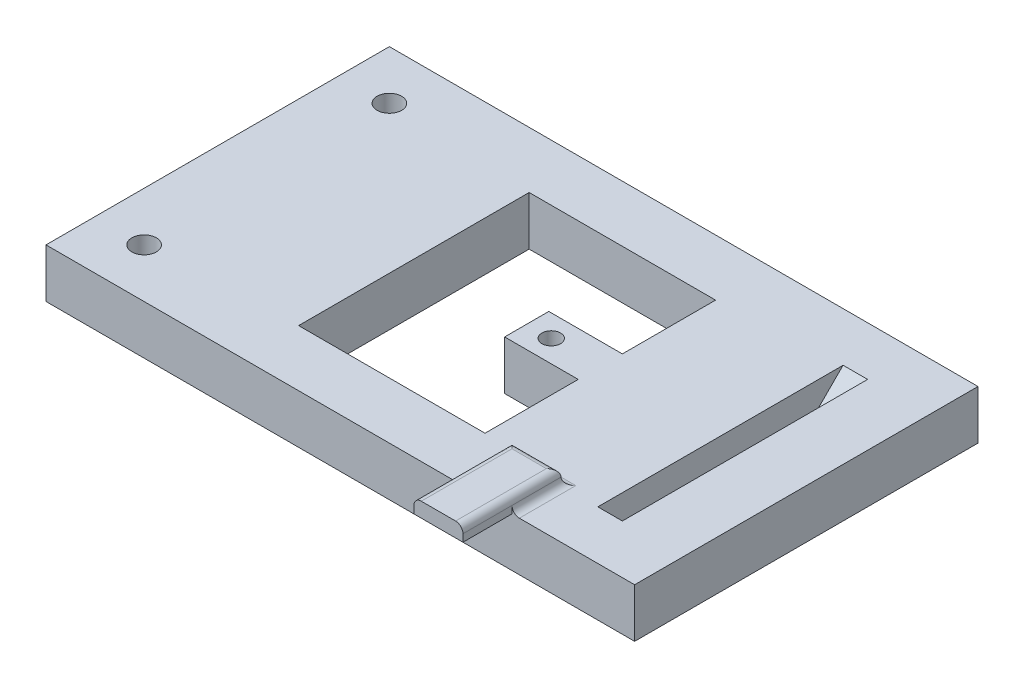
ISO-10303-21;
HEADER;
FILE_DESCRIPTION(('STEP AP214'),'2;1');
FILE_NAME('part.step','',(''),(''),'','','');
FILE_SCHEMA(('AUTOMOTIVE_DESIGN { 1 0 10303 214 1 1 1 1 }'));
ENDSEC;
DATA;
#1=APPLICATION_CONTEXT('core data for automotive mechanical design processes');
#2=APPLICATION_PROTOCOL_DEFINITION('international standard','automotive_design',2000,#1);
#3=PRODUCT_CONTEXT('',#1,'mechanical');
#4=PRODUCT('Part','Part','',(#3));
#5=PRODUCT_RELATED_PRODUCT_CATEGORY('part','',(#4));
#6=PRODUCT_DEFINITION_FORMATION('','',#4);
#7=PRODUCT_DEFINITION_CONTEXT('part definition',#1,'design');
#8=PRODUCT_DEFINITION('design','',#6,#7);
#9=PRODUCT_DEFINITION_SHAPE('','',#8);
#10=(LENGTH_UNIT() NAMED_UNIT(*) SI_UNIT(.MILLI.,.METRE.));
#11=(NAMED_UNIT(*) PLANE_ANGLE_UNIT() SI_UNIT($,.RADIAN.));
#12=(NAMED_UNIT(*) SI_UNIT($,.STERADIAN.) SOLID_ANGLE_UNIT());
#13=UNCERTAINTY_MEASURE_WITH_UNIT(LENGTH_MEASURE(1.E-05),#10,'distance_accuracy_value','');
#14=(GEOMETRIC_REPRESENTATION_CONTEXT(3) GLOBAL_UNCERTAINTY_ASSIGNED_CONTEXT((#13)) GLOBAL_UNIT_ASSIGNED_CONTEXT((#10,
#11,#12)) REPRESENTATION_CONTEXT('',''));
#15=CARTESIAN_POINT('',(0.,0.,0.));
#16=DIRECTION('',(0.,0.,1.));
#17=DIRECTION('',(1.,0.,0.));
#18=AXIS2_PLACEMENT_3D('',#15,#16,#17);
#19=CARTESIAN_POINT('',(0.,10.,0.));
#20=DIRECTION('',(0.,-1.,0.));
#21=DIRECTION('',(0.,0.,-1.));
#22=AXIS2_PLACEMENT_3D('',#19,#20,#21);
#23=PLANE('',#22);
#24=CARTESIAN_POINT('',(8.,10.,0.));
#25=DIRECTION('',(0.,1.,0.));
#26=DIRECTION('',(0.,0.,1.));
#27=AXIS2_PLACEMENT_3D('',#24,#25,#26);
#28=CIRCLE('',#27,1.9);
#29=CARTESIAN_POINT('',(8.,10.,1.9));
#30=VERTEX_POINT('',#29);
#31=EDGE_CURVE('E471',#30,#30,#28,.T.);
#32=ORIENTED_EDGE('',*,*,#31,.F.);
#33=EDGE_LOOP('',(#32));
#34=FACE_BOUND('',#33,.T.);
#35=DIRECTION('',(0.,0.,-1.));
#36=VECTOR('',#35,1.);
#37=CARTESIAN_POINT('',(47.5,10.,15.));
#38=LINE('',#37,#36);
#39=CARTESIAN_POINT('',(47.5,10.,25.));
#40=VERTEX_POINT('',#39);
#41=CARTESIAN_POINT('',(47.5,10.,-25.));
#42=VERTEX_POINT('',#41);
#43=EDGE_CURVE('E458',#40,#42,#38,.T.);
#44=ORIENTED_EDGE('',*,*,#43,.F.);
#45=DIRECTION('',(-1.,0.,0.));
#46=VECTOR('',#45,1.);
#47=CARTESIAN_POINT('',(42.5,10.,25.));
#48=LINE('',#47,#46);
#49=CARTESIAN_POINT('',(42.5,10.,25.));
#50=VERTEX_POINT('',#49);
#51=EDGE_CURVE('E303',#40,#50,#48,.T.);
#52=ORIENTED_EDGE('',*,*,#51,.T.);
#53=DIRECTION('',(0.,0.,1.));
#54=VECTOR('',#53,1.);
#55=CARTESIAN_POINT('',(42.5,10.,15.));
#56=LINE('',#55,#54);
#57=CARTESIAN_POINT('',(42.5,10.,-25.));
#58=VERTEX_POINT('',#57);
#59=EDGE_CURVE('E430',#58,#50,#56,.T.);
#60=ORIENTED_EDGE('',*,*,#59,.F.);
#61=DIRECTION('',(1.,0.,0.));
#62=VECTOR('',#61,1.);
#63=CARTESIAN_POINT('',(47.5,10.,-25.));
#64=LINE('',#63,#62);
#65=EDGE_CURVE('E307',#58,#42,#64,.T.);
#66=ORIENTED_EDGE('',*,*,#65,.T.);
#67=EDGE_LOOP('',(#44,#52,#60,#66));
#68=FACE_BOUND('',#67,.T.);
#69=CARTESIAN_POINT('',(-50.,10.,25.));
#70=DIRECTION('',(0.,1.,0.));
#71=DIRECTION('',(0.,0.,-1.));
#72=AXIS2_PLACEMENT_3D('',#69,#70,#71);
#73=CIRCLE('',#72,2.5);
#74=CARTESIAN_POINT('',(-50.,10.,22.5));
#75=VERTEX_POINT('',#74);
#76=EDGE_CURVE('E359',#75,#75,#73,.T.);
#77=ORIENTED_EDGE('',*,*,#76,.F.);
#78=EDGE_LOOP('',(#77));
#79=FACE_BOUND('',#78,.T.);
#80=CARTESIAN_POINT('',(-50.,10.,-25.));
#81=DIRECTION('',(0.,1.,0.));
#82=DIRECTION('',(0.,0.,1.));
#83=AXIS2_PLACEMENT_3D('',#80,#81,#82);
#84=CIRCLE('',#83,2.5);
#85=CARTESIAN_POINT('',(-50.,10.,-22.5));
#86=VERTEX_POINT('',#85);
#87=EDGE_CURVE('E341',#86,#86,#84,.T.);
#88=ORIENTED_EDGE('',*,*,#87,.F.);
#89=EDGE_LOOP('',(#88));
#90=FACE_BOUND('',#89,.T.);
#91=DIRECTION('',(-1.,0.,0.));
#92=VECTOR('',#91,1.);
#93=CARTESIAN_POINT('',(-20.,10.,-23.5));
#94=LINE('',#93,#92);
#95=CARTESIAN_POINT('',(18.,10.,-23.5));
#96=VERTEX_POINT('',#95);
#97=CARTESIAN_POINT('',(-20.,10.,-23.5));
#98=VERTEX_POINT('',#97);
#99=EDGE_CURVE('E401',#96,#98,#94,.T.);
#100=ORIENTED_EDGE('',*,*,#99,.F.);
#101=DIRECTION('',(0.,0.,-1.));
#102=VECTOR('',#101,1.);
#103=CARTESIAN_POINT('',(18.,10.,-23.5));
#104=LINE('',#103,#102);
#105=CARTESIAN_POINT('',(18.,10.,-4.5));
#106=VERTEX_POINT('',#105);
#107=EDGE_CURVE('E396',#106,#96,#104,.T.);
#108=ORIENTED_EDGE('',*,*,#107,.F.);
#109=DIRECTION('',(1.,0.,0.));
#110=VECTOR('',#109,1.);
#111=CARTESIAN_POINT('',(18.,10.,-4.5));
#112=LINE('',#111,#110);
#113=CARTESIAN_POINT('',(3.,10.,-4.5));
#114=VERTEX_POINT('',#113);
#115=EDGE_CURVE('E433',#114,#106,#112,.T.);
#116=ORIENTED_EDGE('',*,*,#115,.F.);
#117=DIRECTION('',(0.,0.,-1.));
#118=VECTOR('',#117,1.);
#119=CARTESIAN_POINT('',(3.,10.,-4.5));
#120=LINE('',#119,#118);
#121=CARTESIAN_POINT('',(3.,10.,4.5));
#122=VERTEX_POINT('',#121);
#123=EDGE_CURVE('E437',#122,#114,#120,.T.);
#124=ORIENTED_EDGE('',*,*,#123,.F.);
#125=DIRECTION('',(-1.,0.,0.));
#126=VECTOR('',#125,1.);
#127=CARTESIAN_POINT('',(3.,10.,4.5));
#128=LINE('',#127,#126);
#129=CARTESIAN_POINT('',(18.,10.,4.5));
#130=VERTEX_POINT('',#129);
#131=EDGE_CURVE('E440',#130,#122,#128,.T.);
#132=ORIENTED_EDGE('',*,*,#131,.F.);
#133=DIRECTION('',(0.,0.,-1.));
#134=VECTOR('',#133,1.);
#135=CARTESIAN_POINT('',(18.,10.,4.5));
#136=LINE('',#135,#134);
#137=CARTESIAN_POINT('',(18.,10.,23.5));
#138=VERTEX_POINT('',#137);
#139=EDGE_CURVE('E443',#138,#130,#136,.T.);
#140=ORIENTED_EDGE('',*,*,#139,.F.);
#141=DIRECTION('',(1.,0.,0.));
#142=VECTOR('',#141,1.);
#143=CARTESIAN_POINT('',(-20.,10.,23.5));
#144=LINE('',#143,#142);
#145=CARTESIAN_POINT('',(-20.,10.,23.5));
#146=VERTEX_POINT('',#145);
#147=EDGE_CURVE('E446',#146,#138,#144,.T.);
#148=ORIENTED_EDGE('',*,*,#147,.F.);
#149=DIRECTION('',(0.,0.,1.));
#150=VECTOR('',#149,1.);
#151=CARTESIAN_POINT('',(-20.,10.,23.5));
#152=LINE('',#151,#150);
#153=EDGE_CURVE('E449',#98,#146,#152,.T.);
#154=ORIENTED_EDGE('',*,*,#153,.F.);
#155=EDGE_LOOP('',(#100,#108,#116,#124,#132,#140,#148,#154));
#156=FACE_BOUND('',#155,.T.);
#157=DIRECTION('',(-1.,0.,0.));
#158=VECTOR('',#157,1.);
#159=CARTESIAN_POINT('',(35.,10.,23.5));
#160=LINE('',#159,#158);
#161=CARTESIAN_POINT('',(23.5,10.,23.5));
#162=VERTEX_POINT('',#161);
#163=CARTESIAN_POINT('',(36.5,10.,23.5));
#164=VERTEX_POINT('',#163);
#165=EDGE_CURVE('E224',#162,#164,#160,.F.);
#166=ORIENTED_EDGE('',*,*,#165,.T.);
#167=DIRECTION('',(0.,0.,-1.));
#168=VECTOR('',#167,1.);
#169=CARTESIAN_POINT('',(36.5,10.,35.));
#170=LINE('',#169,#168);
#171=CARTESIAN_POINT('',(36.5,10.,35.));
#172=VERTEX_POINT('',#171);
#173=EDGE_CURVE('E234',#164,#172,#170,.F.);
#174=ORIENTED_EDGE('',*,*,#173,.T.);
#175=DIRECTION('',(1.,0.,0.));
#176=VECTOR('',#175,1.);
#177=CARTESIAN_POINT('',(-60.,10.,35.));
#178=LINE('',#177,#176);
#179=CARTESIAN_POINT('',(60.,10.,35.));
#180=VERTEX_POINT('',#179);
#181=EDGE_CURVE('E345',#172,#180,#178,.T.);
#182=ORIENTED_EDGE('',*,*,#181,.T.);
#183=DIRECTION('',(0.,0.,-1.));
#184=VECTOR('',#183,1.);
#185=CARTESIAN_POINT('',(60.,10.,35.));
#186=LINE('',#185,#184);
#187=CARTESIAN_POINT('',(60.,10.,-35.));
#188=VERTEX_POINT('',#187);
#189=EDGE_CURVE('E330',#180,#188,#186,.T.);
#190=ORIENTED_EDGE('',*,*,#189,.T.);
#191=DIRECTION('',(-1.,0.,0.));
#192=VECTOR('',#191,1.);
#193=CARTESIAN_POINT('',(-60.,10.,-35.));
#194=LINE('',#193,#192);
#195=CARTESIAN_POINT('',(-60.,10.,-35.));
#196=VERTEX_POINT('',#195);
#197=EDGE_CURVE('E349',#188,#196,#194,.T.);
#198=ORIENTED_EDGE('',*,*,#197,.T.);
#199=DIRECTION('',(0.,0.,1.));
#200=VECTOR('',#199,1.);
#201=CARTESIAN_POINT('',(-60.,10.,35.));
#202=LINE('',#201,#200);
#203=CARTESIAN_POINT('',(-60.,10.,35.));
#204=VERTEX_POINT('',#203);
#205=EDGE_CURVE('E346',#196,#204,#202,.T.);
#206=ORIENTED_EDGE('',*,*,#205,.T.);
#207=CARTESIAN_POINT('',(23.5,10.,35.));
#208=VERTEX_POINT('',#207);
#209=EDGE_CURVE('E226',#204,#208,#178,.T.);
#210=ORIENTED_EDGE('',*,*,#209,.T.);
#211=DIRECTION('',(0.,0.,1.));
#212=VECTOR('',#211,1.);
#213=CARTESIAN_POINT('',(23.5,10.,25.));
#214=LINE('',#213,#212);
#215=EDGE_CURVE('E223',#208,#162,#214,.F.);
#216=ORIENTED_EDGE('',*,*,#215,.T.);
#217=EDGE_LOOP('',(#166,#174,#182,#190,#198,#206,#210,#216));
#218=FACE_BOUND('',#217,.T.);
#219=ADVANCED_FACE('F41',(#34,#68,#79,#90,#156,#218),#23,.F.);
#220=CARTESIAN_POINT('',(0.,0.,0.));
#221=DIRECTION('',(0.,-1.,0.));
#222=DIRECTION('',(0.,0.,-1.));
#223=AXIS2_PLACEMENT_3D('',#220,#221,#222);
#224=PLANE('',#223);
#225=DIRECTION('',(1.,0.,0.));
#226=VECTOR('',#225,1.);
#227=CARTESIAN_POINT('',(42.5,0.,15.));
#228=LINE('',#227,#226);
#229=CARTESIAN_POINT('',(42.5,0.,15.));
#230=VERTEX_POINT('',#229);
#231=CARTESIAN_POINT('',(47.5,0.,15.));
#232=VERTEX_POINT('',#231);
#233=EDGE_CURVE('E454',#230,#232,#228,.T.);
#234=ORIENTED_EDGE('',*,*,#233,.T.);
#235=DIRECTION('',(0.,0.,-1.));
#236=VECTOR('',#235,1.);
#237=CARTESIAN_POINT('',(47.5,0.,15.));
#238=LINE('',#237,#236);
#239=CARTESIAN_POINT('',(47.5,0.,-15.));
#240=VERTEX_POINT('',#239);
#241=EDGE_CURVE('E467',#232,#240,#238,.T.);
#242=ORIENTED_EDGE('',*,*,#241,.T.);
#243=DIRECTION('',(-1.,0.,0.));
#244=VECTOR('',#243,1.);
#245=CARTESIAN_POINT('',(42.5,0.,-15.));
#246=LINE('',#245,#244);
#247=CARTESIAN_POINT('',(42.5,0.,-15.));
#248=VERTEX_POINT('',#247);
#249=EDGE_CURVE('E463',#240,#248,#246,.T.);
#250=ORIENTED_EDGE('',*,*,#249,.T.);
#251=DIRECTION('',(0.,0.,1.));
#252=VECTOR('',#251,1.);
#253=CARTESIAN_POINT('',(42.5,0.,15.));
#254=LINE('',#253,#252);
#255=EDGE_CURVE('E459',#248,#230,#254,.T.);
#256=ORIENTED_EDGE('',*,*,#255,.T.);
#257=EDGE_LOOP('',(#234,#242,#250,#256));
#258=FACE_BOUND('',#257,.T.);
#259=DIRECTION('',(0.,0.,-1.));
#260=VECTOR('',#259,1.);
#261=CARTESIAN_POINT('',(18.,0.,-23.5));
#262=LINE('',#261,#260);
#263=CARTESIAN_POINT('',(18.,0.,-4.5));
#264=VERTEX_POINT('',#263);
#265=CARTESIAN_POINT('',(18.,0.,-23.5));
#266=VERTEX_POINT('',#265);
#267=EDGE_CURVE('E397',#264,#266,#262,.T.);
#268=ORIENTED_EDGE('',*,*,#267,.T.);
#269=DIRECTION('',(-1.,0.,0.));
#270=VECTOR('',#269,1.);
#271=CARTESIAN_POINT('',(-20.,0.,-23.5));
#272=LINE('',#271,#270);
#273=CARTESIAN_POINT('',(-20.,0.,-23.5));
#274=VERTEX_POINT('',#273);
#275=EDGE_CURVE('E426',#266,#274,#272,.T.);
#276=ORIENTED_EDGE('',*,*,#275,.T.);
#277=DIRECTION('',(0.,0.,1.));
#278=VECTOR('',#277,1.);
#279=CARTESIAN_POINT('',(-20.,0.,23.5));
#280=LINE('',#279,#278);
#281=CARTESIAN_POINT('',(-20.,0.,23.5));
#282=VERTEX_POINT('',#281);
#283=EDGE_CURVE('E422',#274,#282,#280,.T.);
#284=ORIENTED_EDGE('',*,*,#283,.T.);
#285=DIRECTION('',(1.,0.,0.));
#286=VECTOR('',#285,1.);
#287=CARTESIAN_POINT('',(-20.,0.,23.5));
#288=LINE('',#287,#286);
#289=CARTESIAN_POINT('',(18.,0.,23.5));
#290=VERTEX_POINT('',#289);
#291=EDGE_CURVE('E418',#282,#290,#288,.T.);
#292=ORIENTED_EDGE('',*,*,#291,.T.);
#293=DIRECTION('',(0.,0.,-1.));
#294=VECTOR('',#293,1.);
#295=CARTESIAN_POINT('',(18.,0.,4.5));
#296=LINE('',#295,#294);
#297=CARTESIAN_POINT('',(18.,0.,4.5));
#298=VERTEX_POINT('',#297);
#299=EDGE_CURVE('E414',#290,#298,#296,.T.);
#300=ORIENTED_EDGE('',*,*,#299,.T.);
#301=DIRECTION('',(-1.,0.,0.));
#302=VECTOR('',#301,1.);
#303=CARTESIAN_POINT('',(3.,0.,4.5));
#304=LINE('',#303,#302);
#305=CARTESIAN_POINT('',(3.,0.,4.5));
#306=VERTEX_POINT('',#305);
#307=EDGE_CURVE('E410',#298,#306,#304,.T.);
#308=ORIENTED_EDGE('',*,*,#307,.T.);
#309=DIRECTION('',(0.,0.,-1.));
#310=VECTOR('',#309,1.);
#311=CARTESIAN_POINT('',(3.,0.,-4.5));
#312=LINE('',#311,#310);
#313=CARTESIAN_POINT('',(3.,0.,-4.5));
#314=VERTEX_POINT('',#313);
#315=EDGE_CURVE('E406',#306,#314,#312,.T.);
#316=ORIENTED_EDGE('',*,*,#315,.T.);
#317=DIRECTION('',(1.,0.,0.));
#318=VECTOR('',#317,1.);
#319=CARTESIAN_POINT('',(18.,0.,-4.5));
#320=LINE('',#319,#318);
#321=EDGE_CURVE('E402',#314,#264,#320,.T.);
#322=ORIENTED_EDGE('',*,*,#321,.T.);
#323=EDGE_LOOP('',(#268,#276,#284,#292,#300,#308,#316,#322));
#324=FACE_BOUND('',#323,.T.);
#325=CARTESIAN_POINT('',(-50.,0.,25.));
#326=DIRECTION('',(0.,1.,0.));
#327=DIRECTION('',(0.,0.,-1.));
#328=AXIS2_PLACEMENT_3D('',#325,#326,#327);
#329=CIRCLE('',#328,2.5);
#330=CARTESIAN_POINT('',(-50.,0.,22.5));
#331=VERTEX_POINT('',#330);
#332=EDGE_CURVE('E363',#331,#331,#329,.T.);
#333=ORIENTED_EDGE('',*,*,#332,.T.);
#334=EDGE_LOOP('',(#333));
#335=FACE_BOUND('',#334,.T.);
#336=DIRECTION('',(0.,0.,-1.));
#337=VECTOR('',#336,1.);
#338=CARTESIAN_POINT('',(60.,0.,35.));
#339=LINE('',#338,#337);
#340=CARTESIAN_POINT('',(60.,0.,35.));
#341=VERTEX_POINT('',#340);
#342=CARTESIAN_POINT('',(60.,0.,-35.));
#343=VERTEX_POINT('',#342);
#344=EDGE_CURVE('E337',#341,#343,#339,.T.);
#345=ORIENTED_EDGE('',*,*,#344,.F.);
#346=DIRECTION('',(1.,0.,0.));
#347=VECTOR('',#346,1.);
#348=CARTESIAN_POINT('',(-60.,0.,35.));
#349=LINE('',#348,#347);
#350=CARTESIAN_POINT('',(-60.,0.,35.));
#351=VERTEX_POINT('',#350);
#352=EDGE_CURVE('E327',#351,#341,#349,.T.);
#353=ORIENTED_EDGE('',*,*,#352,.F.);
#354=DIRECTION('',(0.,0.,1.));
#355=VECTOR('',#354,1.);
#356=CARTESIAN_POINT('',(-60.,0.,35.));
#357=LINE('',#356,#355);
#358=CARTESIAN_POINT('',(-60.,0.,-35.));
#359=VERTEX_POINT('',#358);
#360=EDGE_CURVE('E331',#359,#351,#357,.T.);
#361=ORIENTED_EDGE('',*,*,#360,.F.);
#362=DIRECTION('',(-1.,0.,0.));
#363=VECTOR('',#362,1.);
#364=CARTESIAN_POINT('',(-60.,0.,-35.));
#365=LINE('',#364,#363);
#366=EDGE_CURVE('E334',#343,#359,#365,.T.);
#367=ORIENTED_EDGE('',*,*,#366,.F.);
#368=EDGE_LOOP('',(#345,#353,#361,#367));
#369=FACE_BOUND('',#368,.T.);
#370=CARTESIAN_POINT('',(-50.,0.,-25.));
#371=DIRECTION('',(0.,1.,0.));
#372=DIRECTION('',(0.,0.,1.));
#373=AXIS2_PLACEMENT_3D('',#370,#371,#372);
#374=CIRCLE('',#373,2.5);
#375=CARTESIAN_POINT('',(-50.,0.,-22.5));
#376=VERTEX_POINT('',#375);
#377=EDGE_CURVE('E355',#376,#376,#374,.T.);
#378=ORIENTED_EDGE('',*,*,#377,.T.);
#379=EDGE_LOOP('',(#378));
#380=FACE_BOUND('',#379,.T.);
#381=CARTESIAN_POINT('',(8.,0.,0.));
#382=DIRECTION('',(0.,1.,0.));
#383=DIRECTION('',(0.,0.,1.));
#384=AXIS2_PLACEMENT_3D('',#381,#382,#383);
#385=CIRCLE('',#384,1.9);
#386=CARTESIAN_POINT('',(8.,0.,1.9));
#387=VERTEX_POINT('',#386);
#388=EDGE_CURVE('E476',#387,#387,#385,.T.);
#389=ORIENTED_EDGE('',*,*,#388,.T.);
#390=EDGE_LOOP('',(#389));
#391=FACE_BOUND('',#390,.T.);
#392=ADVANCED_FACE('F543',(#258,#324,#335,#369,#380,#391),#224,.T.);
#393=CARTESIAN_POINT('',(60.,10.,35.));
#394=DIRECTION('',(-1.,0.,0.));
#395=DIRECTION('',(0.,0.,1.));
#396=AXIS2_PLACEMENT_3D('',#393,#394,#395);
#397=PLANE('',#396);
#398=ORIENTED_EDGE('',*,*,#344,.T.);
#399=DIRECTION('',(0.,-1.,0.));
#400=VECTOR('',#399,1.);
#401=CARTESIAN_POINT('',(60.,10.,-35.));
#402=LINE('',#401,#400);
#403=EDGE_CURVE('E311',#188,#343,#402,.T.);
#404=ORIENTED_EDGE('',*,*,#403,.F.);
#405=ORIENTED_EDGE('',*,*,#189,.F.);
#406=DIRECTION('',(0.,-1.,0.));
#407=VECTOR('',#406,1.);
#408=CARTESIAN_POINT('',(60.,10.,35.));
#409=LINE('',#408,#407);
#410=EDGE_CURVE('E323',#180,#341,#409,.T.);
#411=ORIENTED_EDGE('',*,*,#410,.T.);
#412=EDGE_LOOP('',(#398,#404,#405,#411));
#413=FACE_BOUND('',#412,.T.);
#414=ADVANCED_FACE('F547',(#413),#397,.F.);
#415=CARTESIAN_POINT('',(-60.,10.,-35.));
#416=DIRECTION('',(0.,0.,1.));
#417=DIRECTION('',(1.,0.,0.));
#418=AXIS2_PLACEMENT_3D('',#415,#416,#417);
#419=PLANE('',#418);
#420=ORIENTED_EDGE('',*,*,#366,.T.);
#421=DIRECTION('',(0.,-1.,0.));
#422=VECTOR('',#421,1.);
#423=CARTESIAN_POINT('',(-60.,10.,-35.));
#424=LINE('',#423,#422);
#425=EDGE_CURVE('E315',#196,#359,#424,.T.);
#426=ORIENTED_EDGE('',*,*,#425,.F.);
#427=ORIENTED_EDGE('',*,*,#197,.F.);
#428=ORIENTED_EDGE('',*,*,#403,.T.);
#429=EDGE_LOOP('',(#420,#426,#427,#428));
#430=FACE_BOUND('',#429,.T.);
#431=ADVANCED_FACE('F550',(#430),#419,.F.);
#432=CARTESIAN_POINT('',(-60.,10.,35.));
#433=DIRECTION('',(1.,0.,0.));
#434=DIRECTION('',(0.,0.,-1.));
#435=AXIS2_PLACEMENT_3D('',#432,#433,#434);
#436=PLANE('',#435);
#437=ORIENTED_EDGE('',*,*,#360,.T.);
#438=DIRECTION('',(0.,-1.,0.));
#439=VECTOR('',#438,1.);
#440=CARTESIAN_POINT('',(-60.,10.,35.));
#441=LINE('',#440,#439);
#442=EDGE_CURVE('E319',#204,#351,#441,.T.);
#443=ORIENTED_EDGE('',*,*,#442,.F.);
#444=ORIENTED_EDGE('',*,*,#205,.F.);
#445=ORIENTED_EDGE('',*,*,#425,.T.);
#446=EDGE_LOOP('',(#437,#443,#444,#445));
#447=FACE_BOUND('',#446,.T.);
#448=ADVANCED_FACE('F551',(#447),#436,.F.);
#449=CARTESIAN_POINT('',(-60.,10.,35.));
#450=DIRECTION('',(0.,0.,-1.));
#451=DIRECTION('',(-1.,0.,0.));
#452=AXIS2_PLACEMENT_3D('',#449,#450,#451);
#453=PLANE('',#452);
#454=ORIENTED_EDGE('',*,*,#352,.T.);
#455=ORIENTED_EDGE('',*,*,#410,.F.);
#456=ORIENTED_EDGE('',*,*,#181,.F.);
#457=CARTESIAN_POINT('',(36.5,11.5,35.));
#458=DIRECTION('',(0.,0.,-1.));
#459=DIRECTION('',(-1.,0.,0.));
#460=AXIS2_PLACEMENT_3D('',#457,#458,#459);
#461=CIRCLE('',#460,1.5);
#462=CARTESIAN_POINT('',(35.,11.5,35.));
#463=VERTEX_POINT('',#462);
#464=EDGE_CURVE('E52',#172,#463,#461,.T.);
#465=ORIENTED_EDGE('',*,*,#464,.T.);
#466=DIRECTION('',(0.,1.,0.));
#467=VECTOR('',#466,1.);
#468=CARTESIAN_POINT('',(35.,10.,35.));
#469=LINE('',#468,#467);
#470=CARTESIAN_POINT('',(35.,10.,35.));
#471=VERTEX_POINT('',#470);
#472=EDGE_CURVE('E61',#471,#463,#469,.T.);
#473=ORIENTED_EDGE('',*,*,#472,.F.);
#474=CARTESIAN_POINT('',(25.,10.,35.));
#475=VERTEX_POINT('',#474);
#476=EDGE_CURVE('E344',#475,#471,#178,.T.);
#477=ORIENTED_EDGE('',*,*,#476,.F.);
#478=DIRECTION('',(0.,-1.,0.));
#479=VECTOR('',#478,1.);
#480=CARTESIAN_POINT('',(25.,10.,35.));
#481=LINE('',#480,#479);
#482=CARTESIAN_POINT('',(25.,11.5,35.));
#483=VERTEX_POINT('',#482);
#484=EDGE_CURVE('E270',#483,#475,#481,.T.);
#485=ORIENTED_EDGE('',*,*,#484,.F.);
#486=CARTESIAN_POINT('',(23.5,11.5,35.));
#487=DIRECTION('',(0.,0.,-1.));
#488=DIRECTION('',(-1.,0.,0.));
#489=AXIS2_PLACEMENT_3D('',#486,#487,#488);
#490=CIRCLE('',#489,1.5);
#491=EDGE_CURVE('E11',#483,#208,#490,.T.);
#492=ORIENTED_EDGE('',*,*,#491,.T.);
#493=ORIENTED_EDGE('',*,*,#209,.F.);
#494=ORIENTED_EDGE('',*,*,#442,.T.);
#495=EDGE_LOOP('',(#454,#455,#456,#465,#473,#477,#485,#492,#493,#494));
#496=FACE_BOUND('',#495,.T.);
#497=ADVANCED_FACE('F531',(#496),#453,.F.);
#498=CARTESIAN_POINT('',(-50.,10.,-25.));
#499=DIRECTION('',(0.,-1.,0.));
#500=DIRECTION('',(0.,0.,-1.));
#501=AXIS2_PLACEMENT_3D('',#498,#499,#500);
#502=CYLINDRICAL_SURFACE('',#501,2.5);
#503=ORIENTED_EDGE('',*,*,#87,.T.);
#504=EDGE_LOOP('',(#503));
#505=FACE_BOUND('',#504,.T.);
#506=ORIENTED_EDGE('',*,*,#377,.F.);
#507=EDGE_LOOP('',(#506));
#508=FACE_BOUND('',#507,.T.);
#509=ADVANCED_FACE('F558',(#505,#508),#502,.F.);
#510=CARTESIAN_POINT('',(-50.,10.,25.));
#511=DIRECTION('',(0.,-1.,0.));
#512=DIRECTION('',(0.,0.,-1.));
#513=AXIS2_PLACEMENT_3D('',#510,#511,#512);
#514=CYLINDRICAL_SURFACE('',#513,2.5);
#515=ORIENTED_EDGE('',*,*,#76,.T.);
#516=EDGE_LOOP('',(#515));
#517=FACE_BOUND('',#516,.T.);
#518=ORIENTED_EDGE('',*,*,#332,.F.);
#519=EDGE_LOOP('',(#518));
#520=FACE_BOUND('',#519,.T.);
#521=ADVANCED_FACE('F574',(#517,#520),#514,.F.);
#522=CARTESIAN_POINT('',(-20.,10.,-23.5));
#523=DIRECTION('',(0.,0.,1.));
#524=DIRECTION('',(1.,0.,0.));
#525=AXIS2_PLACEMENT_3D('',#522,#523,#524);
#526=PLANE('',#525);
#527=ORIENTED_EDGE('',*,*,#275,.F.);
#528=DIRECTION('',(0.,-1.,0.));
#529=VECTOR('',#528,1.);
#530=CARTESIAN_POINT('',(18.,10.,-23.5));
#531=LINE('',#530,#529);
#532=EDGE_CURVE('E392',#96,#266,#531,.T.);
#533=ORIENTED_EDGE('',*,*,#532,.F.);
#534=ORIENTED_EDGE('',*,*,#99,.T.);
#535=DIRECTION('',(0.,-1.,0.));
#536=VECTOR('',#535,1.);
#537=CARTESIAN_POINT('',(-20.,10.,-23.5));
#538=LINE('',#537,#536);
#539=EDGE_CURVE('E367',#98,#274,#538,.T.);
#540=ORIENTED_EDGE('',*,*,#539,.T.);
#541=EDGE_LOOP('',(#527,#533,#534,#540));
#542=FACE_BOUND('',#541,.T.);
#543=ADVANCED_FACE('F578',(#542),#526,.T.);
#544=CARTESIAN_POINT('',(-20.,10.,23.5));
#545=DIRECTION('',(1.,0.,0.));
#546=DIRECTION('',(0.,0.,-1.));
#547=AXIS2_PLACEMENT_3D('',#544,#545,#546);
#548=PLANE('',#547);
#549=ORIENTED_EDGE('',*,*,#283,.F.);
#550=ORIENTED_EDGE('',*,*,#539,.F.);
#551=ORIENTED_EDGE('',*,*,#153,.T.);
#552=DIRECTION('',(0.,-1.,0.));
#553=VECTOR('',#552,1.);
#554=CARTESIAN_POINT('',(-20.,10.,23.5));
#555=LINE('',#554,#553);
#556=EDGE_CURVE('E374',#146,#282,#555,.T.);
#557=ORIENTED_EDGE('',*,*,#556,.T.);
#558=EDGE_LOOP('',(#549,#550,#551,#557));
#559=FACE_BOUND('',#558,.T.);
#560=ADVANCED_FACE('F582',(#559),#548,.T.);
#561=CARTESIAN_POINT('',(-20.,10.,23.5));
#562=DIRECTION('',(0.,0.,-1.));
#563=DIRECTION('',(-1.,0.,0.));
#564=AXIS2_PLACEMENT_3D('',#561,#562,#563);
#565=PLANE('',#564);
#566=ORIENTED_EDGE('',*,*,#291,.F.);
#567=ORIENTED_EDGE('',*,*,#556,.F.);
#568=ORIENTED_EDGE('',*,*,#147,.T.);
#569=DIRECTION('',(0.,-1.,0.));
#570=VECTOR('',#569,1.);
#571=CARTESIAN_POINT('',(18.,10.,23.5));
#572=LINE('',#571,#570);
#573=EDGE_CURVE('E377',#138,#290,#572,.T.);
#574=ORIENTED_EDGE('',*,*,#573,.T.);
#575=EDGE_LOOP('',(#566,#567,#568,#574));
#576=FACE_BOUND('',#575,.T.);
#577=ADVANCED_FACE('F586',(#576),#565,.T.);
#578=CARTESIAN_POINT('',(18.,10.,4.5));
#579=DIRECTION('',(-1.,0.,0.));
#580=DIRECTION('',(0.,0.,1.));
#581=AXIS2_PLACEMENT_3D('',#578,#579,#580);
#582=PLANE('',#581);
#583=ORIENTED_EDGE('',*,*,#299,.F.);
#584=ORIENTED_EDGE('',*,*,#573,.F.);
#585=ORIENTED_EDGE('',*,*,#139,.T.);
#586=DIRECTION('',(0.,-1.,0.));
#587=VECTOR('',#586,1.);
#588=CARTESIAN_POINT('',(18.,10.,4.5));
#589=LINE('',#588,#587);
#590=EDGE_CURVE('E380',#130,#298,#589,.T.);
#591=ORIENTED_EDGE('',*,*,#590,.T.);
#592=EDGE_LOOP('',(#583,#584,#585,#591));
#593=FACE_BOUND('',#592,.T.);
#594=ADVANCED_FACE('F590',(#593),#582,.T.);
#595=CARTESIAN_POINT('',(3.,10.,4.5));
#596=DIRECTION('',(0.,0.,1.));
#597=DIRECTION('',(1.,0.,0.));
#598=AXIS2_PLACEMENT_3D('',#595,#596,#597);
#599=PLANE('',#598);
#600=ORIENTED_EDGE('',*,*,#307,.F.);
#601=ORIENTED_EDGE('',*,*,#590,.F.);
#602=ORIENTED_EDGE('',*,*,#131,.T.);
#603=DIRECTION('',(0.,-1.,0.));
#604=VECTOR('',#603,1.);
#605=CARTESIAN_POINT('',(3.,10.,4.5));
#606=LINE('',#605,#604);
#607=EDGE_CURVE('E383',#122,#306,#606,.T.);
#608=ORIENTED_EDGE('',*,*,#607,.T.);
#609=EDGE_LOOP('',(#600,#601,#602,#608));
#610=FACE_BOUND('',#609,.T.);
#611=ADVANCED_FACE('F594',(#610),#599,.T.);
#612=CARTESIAN_POINT('',(3.,10.,-4.5));
#613=DIRECTION('',(-1.,0.,0.));
#614=DIRECTION('',(0.,0.,1.));
#615=AXIS2_PLACEMENT_3D('',#612,#613,#614);
#616=PLANE('',#615);
#617=ORIENTED_EDGE('',*,*,#315,.F.);
#618=ORIENTED_EDGE('',*,*,#607,.F.);
#619=ORIENTED_EDGE('',*,*,#123,.T.);
#620=DIRECTION('',(0.,-1.,0.));
#621=VECTOR('',#620,1.);
#622=CARTESIAN_POINT('',(3.,10.,-4.5));
#623=LINE('',#622,#621);
#624=EDGE_CURVE('E386',#114,#314,#623,.T.);
#625=ORIENTED_EDGE('',*,*,#624,.T.);
#626=EDGE_LOOP('',(#617,#618,#619,#625));
#627=FACE_BOUND('',#626,.T.);
#628=ADVANCED_FACE('F598',(#627),#616,.T.);
#629=CARTESIAN_POINT('',(18.,10.,-4.5));
#630=DIRECTION('',(0.,0.,-1.));
#631=DIRECTION('',(-1.,0.,0.));
#632=AXIS2_PLACEMENT_3D('',#629,#630,#631);
#633=PLANE('',#632);
#634=ORIENTED_EDGE('',*,*,#321,.F.);
#635=ORIENTED_EDGE('',*,*,#624,.F.);
#636=ORIENTED_EDGE('',*,*,#115,.T.);
#637=DIRECTION('',(0.,-1.,0.));
#638=VECTOR('',#637,1.);
#639=CARTESIAN_POINT('',(18.,10.,-4.5));
#640=LINE('',#639,#638);
#641=EDGE_CURVE('E389',#106,#264,#640,.T.);
#642=ORIENTED_EDGE('',*,*,#641,.T.);
#643=EDGE_LOOP('',(#634,#635,#636,#642));
#644=FACE_BOUND('',#643,.T.);
#645=ADVANCED_FACE('F602',(#644),#633,.T.);
#646=CARTESIAN_POINT('',(18.,10.,-23.5));
#647=DIRECTION('',(-1.,0.,0.));
#648=DIRECTION('',(0.,0.,1.));
#649=AXIS2_PLACEMENT_3D('',#646,#647,#648);
#650=PLANE('',#649);
#651=ORIENTED_EDGE('',*,*,#267,.F.);
#652=ORIENTED_EDGE('',*,*,#641,.F.);
#653=ORIENTED_EDGE('',*,*,#107,.T.);
#654=ORIENTED_EDGE('',*,*,#532,.T.);
#655=EDGE_LOOP('',(#651,#652,#653,#654));
#656=FACE_BOUND('',#655,.T.);
#657=ADVANCED_FACE('F606',(#656),#650,.T.);
#658=CARTESIAN_POINT('',(47.5,10.,15.));
#659=DIRECTION('',(-1.,0.,0.));
#660=DIRECTION('',(0.,0.,1.));
#661=AXIS2_PLACEMENT_3D('',#658,#659,#660);
#662=PLANE('',#661);
#663=ORIENTED_EDGE('',*,*,#241,.F.);
#664=DIRECTION('',(0.,0.707106781186546,0.707106781186549));
#665=VECTOR('',#664,1.);
#666=CARTESIAN_POINT('',(47.5,0.,15.));
#667=LINE('',#666,#665);
#668=EDGE_CURVE('E299',#232,#40,#667,.T.);
#669=ORIENTED_EDGE('',*,*,#668,.T.);
#670=ORIENTED_EDGE('',*,*,#43,.T.);
#671=DIRECTION('',(0.,-0.707106781186547,0.707106781186548));
#672=VECTOR('',#671,1.);
#673=CARTESIAN_POINT('',(47.5,0.,-15.));
#674=LINE('',#673,#672);
#675=EDGE_CURVE('E289',#42,#240,#674,.T.);
#676=ORIENTED_EDGE('',*,*,#675,.T.);
#677=EDGE_LOOP('',(#663,#669,#670,#676));
#678=FACE_BOUND('',#677,.T.);
#679=ADVANCED_FACE('F610',(#678),#662,.T.);
#680=CARTESIAN_POINT('',(42.5,10.,15.));
#681=DIRECTION('',(1.,0.,0.));
#682=DIRECTION('',(0.,0.,-1.));
#683=AXIS2_PLACEMENT_3D('',#680,#681,#682);
#684=PLANE('',#683);
#685=ORIENTED_EDGE('',*,*,#255,.F.);
#686=DIRECTION('',(0.,0.707106781186547,-0.707106781186548));
#687=VECTOR('',#686,1.);
#688=CARTESIAN_POINT('',(42.5,0.,-15.));
#689=LINE('',#688,#687);
#690=EDGE_CURVE('E292',#248,#58,#689,.T.);
#691=ORIENTED_EDGE('',*,*,#690,.T.);
#692=ORIENTED_EDGE('',*,*,#59,.T.);
#693=DIRECTION('',(0.,-0.707106781186546,-0.707106781186549));
#694=VECTOR('',#693,1.);
#695=CARTESIAN_POINT('',(42.5,0.,15.));
#696=LINE('',#695,#694);
#697=EDGE_CURVE('E296',#50,#230,#696,.T.);
#698=ORIENTED_EDGE('',*,*,#697,.T.);
#699=EDGE_LOOP('',(#685,#691,#692,#698));
#700=FACE_BOUND('',#699,.T.);
#701=ADVANCED_FACE('F614',(#700),#684,.T.);
#702=CARTESIAN_POINT('',(8.,10.,0.));
#703=DIRECTION('',(0.,-1.,0.));
#704=DIRECTION('',(0.,0.,-1.));
#705=AXIS2_PLACEMENT_3D('',#702,#703,#704);
#706=CYLINDRICAL_SURFACE('',#705,1.9);
#707=ORIENTED_EDGE('',*,*,#31,.T.);
#708=EDGE_LOOP('',(#707));
#709=FACE_BOUND('',#708,.T.);
#710=ORIENTED_EDGE('',*,*,#388,.F.);
#711=EDGE_LOOP('',(#710));
#712=FACE_BOUND('',#711,.T.);
#713=ADVANCED_FACE('F618',(#709,#712),#706,.F.);
#714=CARTESIAN_POINT('',(42.5,0.,15.));
#715=DIRECTION('',(0.,0.707106781186549,-0.707106781186546));
#716=DIRECTION('',(-1.,0.,0.));
#717=AXIS2_PLACEMENT_3D('',#714,#715,#716);
#718=PLANE('',#717);
#719=ORIENTED_EDGE('',*,*,#697,.F.);
#720=ORIENTED_EDGE('',*,*,#51,.F.);
#721=ORIENTED_EDGE('',*,*,#668,.F.);
#722=ORIENTED_EDGE('',*,*,#233,.F.);
#723=EDGE_LOOP('',(#719,#720,#721,#722));
#724=FACE_BOUND('',#723,.T.);
#725=ADVANCED_FACE('F622',(#724),#718,.T.);
#726=CARTESIAN_POINT('',(42.5,0.,-15.));
#727=DIRECTION('',(0.,0.707106781186548,0.707106781186547));
#728=DIRECTION('',(1.,0.,0.));
#729=AXIS2_PLACEMENT_3D('',#726,#727,#728);
#730=PLANE('',#729);
#731=ORIENTED_EDGE('',*,*,#675,.F.);
#732=ORIENTED_EDGE('',*,*,#65,.F.);
#733=ORIENTED_EDGE('',*,*,#690,.F.);
#734=ORIENTED_EDGE('',*,*,#249,.F.);
#735=EDGE_LOOP('',(#731,#732,#733,#734));
#736=FACE_BOUND('',#735,.T.);
#737=ADVANCED_FACE('F626',(#736),#730,.T.);
#738=CARTESIAN_POINT('',(35.,13.,45.));
#739=DIRECTION('',(-1.,0.,0.));
#740=DIRECTION('',(0.,0.,1.));
#741=AXIS2_PLACEMENT_3D('',#738,#739,#740);
#742=PLANE('',#741);
#743=ORIENTED_EDGE('',*,*,#472,.T.);
#744=DIRECTION('',(0.,0.,-1.));
#745=VECTOR('',#744,1.);
#746=CARTESIAN_POINT('',(35.,11.5,45.));
#747=LINE('',#746,#745);
#748=CARTESIAN_POINT('',(35.,11.5,45.));
#749=VERTEX_POINT('',#748);
#750=EDGE_CURVE('E230',#463,#749,#747,.F.);
#751=ORIENTED_EDGE('',*,*,#750,.T.);
#752=DIRECTION('',(0.,-1.,0.));
#753=VECTOR('',#752,1.);
#754=CARTESIAN_POINT('',(35.,13.,45.));
#755=LINE('',#754,#753);
#756=CARTESIAN_POINT('',(35.,10.,45.));
#757=VERTEX_POINT('',#756);
#758=EDGE_CURVE('E485',#749,#757,#755,.T.);
#759=ORIENTED_EDGE('',*,*,#758,.T.);
#760=DIRECTION('',(0.,0.,-1.));
#761=VECTOR('',#760,1.);
#762=CARTESIAN_POINT('',(35.,10.,45.));
#763=LINE('',#762,#761);
#764=EDGE_CURVE('E495',#757,#471,#763,.T.);
#765=ORIENTED_EDGE('',*,*,#764,.T.);
#766=EDGE_LOOP('',(#743,#751,#759,#765));
#767=FACE_BOUND('',#766,.T.);
#768=ADVANCED_FACE('F528',(#767),#742,.F.);
#769=CARTESIAN_POINT('',(25.,13.,45.));
#770=DIRECTION('',(1.,0.,0.));
#771=DIRECTION('',(0.,0.,-1.));
#772=AXIS2_PLACEMENT_3D('',#769,#770,#771);
#773=PLANE('',#772);
#774=DIRECTION('',(0.,-1.,0.));
#775=VECTOR('',#774,1.);
#776=CARTESIAN_POINT('',(25.,13.,45.));
#777=LINE('',#776,#775);
#778=CARTESIAN_POINT('',(25.,11.5,45.));
#779=VERTEX_POINT('',#778);
#780=CARTESIAN_POINT('',(25.,10.,45.));
#781=VERTEX_POINT('',#780);
#782=EDGE_CURVE('E89',#779,#781,#777,.T.);
#783=ORIENTED_EDGE('',*,*,#782,.F.);
#784=DIRECTION('',(0.,0.,1.));
#785=VECTOR('',#784,1.);
#786=CARTESIAN_POINT('',(25.,11.5,45.));
#787=LINE('',#786,#785);
#788=EDGE_CURVE('E266',#779,#483,#787,.F.);
#789=ORIENTED_EDGE('',*,*,#788,.T.);
#790=ORIENTED_EDGE('',*,*,#484,.T.);
#791=DIRECTION('',(0.,0.,1.));
#792=VECTOR('',#791,1.);
#793=CARTESIAN_POINT('',(25.,10.,45.));
#794=LINE('',#793,#792);
#795=EDGE_CURVE('E492',#475,#781,#794,.T.);
#796=ORIENTED_EDGE('',*,*,#795,.T.);
#797=EDGE_LOOP('',(#783,#789,#790,#796));
#798=FACE_BOUND('',#797,.T.);
#799=ADVANCED_FACE('F519',(#798),#773,.F.);
#800=CARTESIAN_POINT('',(25.,13.,45.));
#801=DIRECTION('',(0.,0.,-1.));
#802=DIRECTION('',(-1.,0.,0.));
#803=AXIS2_PLACEMENT_3D('',#800,#801,#802);
#804=PLANE('',#803);
#805=DIRECTION('',(1.,0.,0.));
#806=VECTOR('',#805,1.);
#807=CARTESIAN_POINT('',(25.,13.,45.));
#808=LINE('',#807,#806);
#809=CARTESIAN_POINT('',(26.5,13.,45.));
#810=VERTEX_POINT('',#809);
#811=CARTESIAN_POINT('',(33.5,13.,45.));
#812=VERTEX_POINT('',#811);
#813=EDGE_CURVE('E488',#810,#812,#808,.T.);
#814=ORIENTED_EDGE('',*,*,#813,.F.);
#815=CARTESIAN_POINT('',(26.5,11.5,45.));
#816=DIRECTION('',(0.,0.,-1.));
#817=DIRECTION('',(-1.,0.,0.));
#818=AXIS2_PLACEMENT_3D('',#815,#816,#817);
#819=CIRCLE('',#818,1.5);
#820=EDGE_CURVE('E273',#810,#779,#819,.F.);
#821=ORIENTED_EDGE('',*,*,#820,.T.);
#822=ORIENTED_EDGE('',*,*,#782,.T.);
#823=DIRECTION('',(1.,0.,0.));
#824=VECTOR('',#823,1.);
#825=CARTESIAN_POINT('',(25.,10.,45.));
#826=LINE('',#825,#824);
#827=EDGE_CURVE('E489',#781,#757,#826,.T.);
#828=ORIENTED_EDGE('',*,*,#827,.T.);
#829=ORIENTED_EDGE('',*,*,#758,.F.);
#830=CARTESIAN_POINT('',(33.5,11.5,45.));
#831=DIRECTION('',(0.,0.,-1.));
#832=DIRECTION('',(-1.,0.,0.));
#833=AXIS2_PLACEMENT_3D('',#830,#831,#832);
#834=CIRCLE('',#833,1.5);
#835=EDGE_CURVE('E276',#749,#812,#834,.F.);
#836=ORIENTED_EDGE('',*,*,#835,.T.);
#837=EDGE_LOOP('',(#814,#821,#822,#828,#829,#836));
#838=FACE_BOUND('',#837,.T.);
#839=ADVANCED_FACE('F517',(#838),#804,.F.);
#840=CARTESIAN_POINT('',(0.,13.,0.));
#841=DIRECTION('',(0.,-1.,0.));
#842=DIRECTION('',(0.,0.,-1.));
#843=AXIS2_PLACEMENT_3D('',#840,#841,#842);
#844=PLANE('',#843);
#845=DIRECTION('',(-1.,0.,0.));
#846=VECTOR('',#845,1.);
#847=CARTESIAN_POINT('',(0.,13.,26.5));
#848=LINE('',#847,#846);
#849=CARTESIAN_POINT('',(33.5,13.,26.5));
#850=VERTEX_POINT('',#849);
#851=CARTESIAN_POINT('',(26.5,13.,26.5));
#852=VERTEX_POINT('',#851);
#853=EDGE_CURVE('E286',#850,#852,#848,.T.);
#854=ORIENTED_EDGE('',*,*,#853,.T.);
#855=DIRECTION('',(0.,0.,1.));
#856=VECTOR('',#855,1.);
#857=CARTESIAN_POINT('',(26.5,13.,0.));
#858=LINE('',#857,#856);
#859=EDGE_CURVE('E279',#852,#810,#858,.T.);
#860=ORIENTED_EDGE('',*,*,#859,.T.);
#861=ORIENTED_EDGE('',*,*,#813,.T.);
#862=DIRECTION('',(0.,0.,-1.));
#863=VECTOR('',#862,1.);
#864=CARTESIAN_POINT('',(33.5,13.,0.));
#865=LINE('',#864,#863);
#866=EDGE_CURVE('E283',#812,#850,#865,.T.);
#867=ORIENTED_EDGE('',*,*,#866,.T.);
#868=EDGE_LOOP('',(#854,#860,#861,#867));
#869=FACE_BOUND('',#868,.T.);
#870=ADVANCED_FACE('F503',(#869),#844,.F.);
#871=CARTESIAN_POINT('',(0.,10.,0.));
#872=DIRECTION('',(0.,-1.,0.));
#873=DIRECTION('',(0.,0.,-1.));
#874=AXIS2_PLACEMENT_3D('',#871,#872,#873);
#875=PLANE('',#874);
#876=ORIENTED_EDGE('',*,*,#795,.F.);
#877=ORIENTED_EDGE('',*,*,#476,.T.);
#878=ORIENTED_EDGE('',*,*,#764,.F.);
#879=ORIENTED_EDGE('',*,*,#827,.F.);
#880=EDGE_LOOP('',(#876,#877,#878,#879));
#881=FACE_BOUND('',#880,.T.);
#882=ADVANCED_FACE('F525',(#881),#875,.T.);
#883=CARTESIAN_POINT('',(36.5,11.5,45.));
#884=DIRECTION('',(0.,0.,1.));
#885=DIRECTION('',(1.,0.,0.));
#886=AXIS2_PLACEMENT_3D('',#883,#884,#885);
#887=CYLINDRICAL_SURFACE('',#886,1.5);
#888=ORIENTED_EDGE('',*,*,#464,.F.);
#889=ORIENTED_EDGE('',*,*,#173,.F.);
#890=CARTESIAN_POINT('',(36.5,11.5,23.5));
#891=DIRECTION('',(0.707106781186547,0.,0.707106781186547));
#892=DIRECTION('',(0.707106781186547,0.,-0.707106781186547));
#893=AXIS2_PLACEMENT_3D('',#890,#891,#892);
#894=ELLIPSE('',#893,2.12132034355964,1.5);
#895=CARTESIAN_POINT('',(35.,11.5,25.));
#896=VERTEX_POINT('',#895);
#897=EDGE_CURVE('E45',#896,#164,#894,.T.);
#898=ORIENTED_EDGE('',*,*,#897,.F.);
#899=DIRECTION('',(0.,0.,-1.));
#900=VECTOR('',#899,1.);
#901=CARTESIAN_POINT('',(35.,11.5,25.));
#902=LINE('',#901,#900);
#903=EDGE_CURVE('E242',#463,#896,#902,.T.);
#904=ORIENTED_EDGE('',*,*,#903,.F.);
#905=EDGE_LOOP('',(#888,#889,#898,#904));
#906=FACE_BOUND('',#905,.T.);
#907=ADVANCED_FACE('F43',(#906),#887,.F.);
#908=CARTESIAN_POINT('',(25.,11.5,23.5));
#909=DIRECTION('',(1.,0.,0.));
#910=DIRECTION('',(0.,0.,-1.));
#911=AXIS2_PLACEMENT_3D('',#908,#909,#910);
#912=CYLINDRICAL_SURFACE('',#911,1.5);
#913=ORIENTED_EDGE('',*,*,#897,.T.);
#914=ORIENTED_EDGE('',*,*,#165,.F.);
#915=CARTESIAN_POINT('',(23.5,11.5,23.5));
#916=DIRECTION('',(0.707106781186547,0.,-0.707106781186547));
#917=DIRECTION('',(-0.707106781186547,0.,-0.707106781186547));
#918=AXIS2_PLACEMENT_3D('',#915,#916,#917);
#919=ELLIPSE('',#918,2.12132034355964,1.5);
#920=CARTESIAN_POINT('',(25.,11.5,25.));
#921=VERTEX_POINT('',#920);
#922=EDGE_CURVE('E73',#921,#162,#919,.T.);
#923=ORIENTED_EDGE('',*,*,#922,.F.);
#924=DIRECTION('',(-1.,0.,0.));
#925=VECTOR('',#924,1.);
#926=CARTESIAN_POINT('',(25.,11.5,25.));
#927=LINE('',#926,#925);
#928=EDGE_CURVE('E243',#896,#921,#927,.T.);
#929=ORIENTED_EDGE('',*,*,#928,.F.);
#930=EDGE_LOOP('',(#913,#914,#923,#929));
#931=FACE_BOUND('',#930,.T.);
#932=ADVANCED_FACE('F232',(#931),#912,.F.);
#933=CARTESIAN_POINT('',(33.5,11.5,0.));
#934=DIRECTION('',(0.,0.,-1.));
#935=DIRECTION('',(-1.,0.,0.));
#936=AXIS2_PLACEMENT_3D('',#933,#934,#935);
#937=CYLINDRICAL_SURFACE('',#936,1.5);
#938=ORIENTED_EDGE('',*,*,#750,.F.);
#939=ORIENTED_EDGE('',*,*,#903,.T.);
#940=CARTESIAN_POINT('',(33.5,11.5,26.5));
#941=DIRECTION('',(-0.707106781186547,0.,-0.707106781186547));
#942=DIRECTION('',(-0.707106781186547,0.,0.707106781186547));
#943=AXIS2_PLACEMENT_3D('',#940,#941,#942);
#944=ELLIPSE('',#943,2.12132034355964,1.5);
#945=EDGE_CURVE('E247',#850,#896,#944,.T.);
#946=ORIENTED_EDGE('',*,*,#945,.F.);
#947=ORIENTED_EDGE('',*,*,#866,.F.);
#948=ORIENTED_EDGE('',*,*,#835,.F.);
#949=EDGE_LOOP('',(#938,#939,#946,#947,#948));
#950=FACE_BOUND('',#949,.T.);
#951=ADVANCED_FACE('F509',(#950),#937,.T.);
#952=CARTESIAN_POINT('',(23.5,11.5,45.));
#953=DIRECTION('',(0.,0.,-1.));
#954=DIRECTION('',(-1.,0.,0.));
#955=AXIS2_PLACEMENT_3D('',#952,#953,#954);
#956=CYLINDRICAL_SURFACE('',#955,1.5);
#957=ORIENTED_EDGE('',*,*,#215,.F.);
#958=ORIENTED_EDGE('',*,*,#491,.F.);
#959=DIRECTION('',(0.,0.,1.));
#960=VECTOR('',#959,1.);
#961=CARTESIAN_POINT('',(25.,11.5,35.));
#962=LINE('',#961,#960);
#963=EDGE_CURVE('E239',#921,#483,#962,.T.);
#964=ORIENTED_EDGE('',*,*,#963,.F.);
#965=ORIENTED_EDGE('',*,*,#922,.T.);
#966=EDGE_LOOP('',(#957,#958,#964,#965));
#967=FACE_BOUND('',#966,.T.);
#968=ADVANCED_FACE('F237',(#967),#956,.F.);
#969=CARTESIAN_POINT('',(0.,11.5,26.5));
#970=DIRECTION('',(-1.,0.,0.));
#971=DIRECTION('',(0.,0.,1.));
#972=AXIS2_PLACEMENT_3D('',#969,#970,#971);
#973=CYLINDRICAL_SURFACE('',#972,1.5);
#974=ORIENTED_EDGE('',*,*,#945,.T.);
#975=ORIENTED_EDGE('',*,*,#928,.T.);
#976=CARTESIAN_POINT('',(26.5,11.5,26.5));
#977=DIRECTION('',(-0.707106781186547,0.,0.707106781186547));
#978=DIRECTION('',(-0.707106781186547,0.,-0.707106781186547));
#979=AXIS2_PLACEMENT_3D('',#976,#977,#978);
#980=ELLIPSE('',#979,2.12132034355964,1.5);
#981=EDGE_CURVE('E255',#852,#921,#980,.T.);
#982=ORIENTED_EDGE('',*,*,#981,.F.);
#983=ORIENTED_EDGE('',*,*,#853,.F.);
#984=EDGE_LOOP('',(#974,#975,#982,#983));
#985=FACE_BOUND('',#984,.T.);
#986=ADVANCED_FACE('F513',(#985),#973,.T.);
#987=CARTESIAN_POINT('',(26.5,11.5,0.));
#988=DIRECTION('',(0.,0.,1.));
#989=DIRECTION('',(1.,0.,0.));
#990=AXIS2_PLACEMENT_3D('',#987,#988,#989);
#991=CYLINDRICAL_SURFACE('',#990,1.5);
#992=ORIENTED_EDGE('',*,*,#963,.T.);
#993=ORIENTED_EDGE('',*,*,#788,.F.);
#994=ORIENTED_EDGE('',*,*,#820,.F.);
#995=ORIENTED_EDGE('',*,*,#859,.F.);
#996=ORIENTED_EDGE('',*,*,#981,.T.);
#997=EDGE_LOOP('',(#992,#993,#994,#995,#996));
#998=FACE_BOUND('',#997,.T.);
#999=ADVANCED_FACE('F515',(#998),#991,.T.);
#1000=CLOSED_SHELL('',(#219,#392,#414,#431,#448,#497,#509,#521,#543,#560,#577,#594,#611,#628,
#645,#657,#679,#701,#713,#725,#737,#768,#799,#839,#870,#882,#907,#932,#951,#968,#986,#999));
#1001=MANIFOLD_SOLID_BREP('B2',#1000);
#1002=ADVANCED_BREP_SHAPE_REPRESENTATION('',(#18,#1001),#14);
#1003=SHAPE_DEFINITION_REPRESENTATION(#9,#1002);
ENDSEC;
END-ISO-10303-21;
